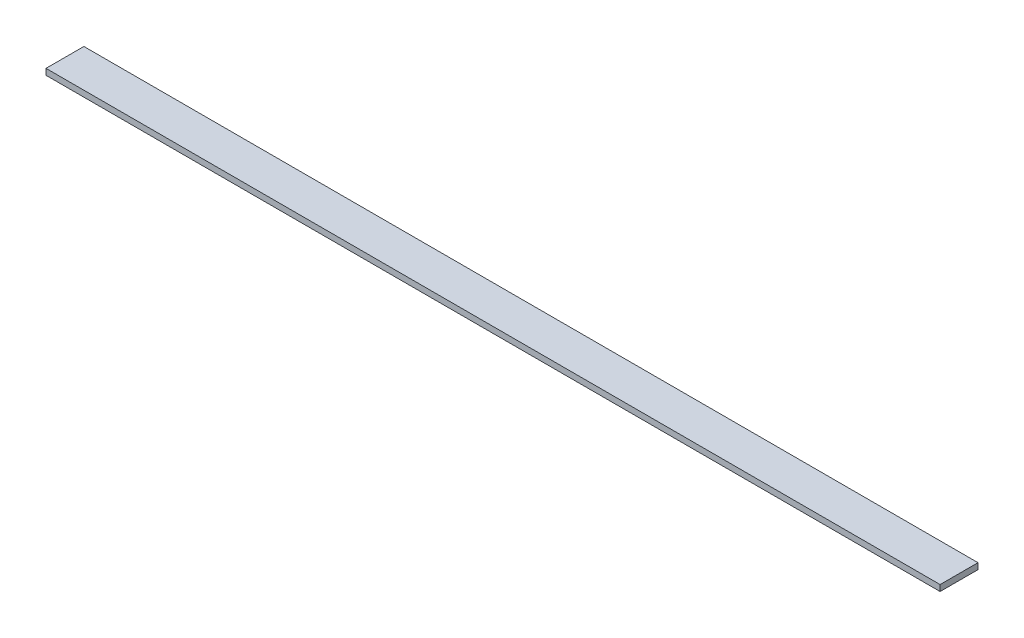
ISO-10303-21;
HEADER;
FILE_DESCRIPTION(('STEP AP214'),'2;1');
FILE_NAME('part.step','',(''),(''),'','','');
FILE_SCHEMA(('AUTOMOTIVE_DESIGN { 1 0 10303 214 1 1 1 1 }'));
ENDSEC;
DATA;
#1=APPLICATION_CONTEXT('core data for automotive mechanical design processes');
#2=APPLICATION_PROTOCOL_DEFINITION('international standard','automotive_design',2000,#1);
#3=PRODUCT_CONTEXT('',#1,'mechanical');
#4=PRODUCT('Part','Part','',(#3));
#5=PRODUCT_RELATED_PRODUCT_CATEGORY('part','',(#4));
#6=PRODUCT_DEFINITION_FORMATION('','',#4);
#7=PRODUCT_DEFINITION_CONTEXT('part definition',#1,'design');
#8=PRODUCT_DEFINITION('design','',#6,#7);
#9=PRODUCT_DEFINITION_SHAPE('','',#8);
#10=(LENGTH_UNIT() NAMED_UNIT(*) SI_UNIT(.MILLI.,.METRE.));
#11=(NAMED_UNIT(*) PLANE_ANGLE_UNIT() SI_UNIT($,.RADIAN.));
#12=(NAMED_UNIT(*) SI_UNIT($,.STERADIAN.) SOLID_ANGLE_UNIT());
#13=UNCERTAINTY_MEASURE_WITH_UNIT(LENGTH_MEASURE(1.E-05),#10,'distance_accuracy_value','');
#14=(GEOMETRIC_REPRESENTATION_CONTEXT(3) GLOBAL_UNCERTAINTY_ASSIGNED_CONTEXT((#13)) GLOBAL_UNIT_ASSIGNED_CONTEXT((#10,
#11,#12)) REPRESENTATION_CONTEXT('',''));
#15=CARTESIAN_POINT('',(0.,0.,0.));
#16=DIRECTION('',(0.,0.,1.));
#17=DIRECTION('',(1.,0.,0.));
#18=AXIS2_PLACEMENT_3D('',#15,#16,#17);
#19=CARTESIAN_POINT('',(590.,8.,-25.));
#20=DIRECTION('',(-1.,0.,0.));
#21=DIRECTION('',(0.,0.,1.));
#22=AXIS2_PLACEMENT_3D('',#19,#20,#21);
#23=PLANE('',#22);
#24=DIRECTION('',(0.,0.,-1.));
#25=VECTOR('',#24,1.);
#26=CARTESIAN_POINT('',(590.,0.,-25.));
#27=LINE('',#26,#25);
#28=CARTESIAN_POINT('',(590.,0.,25.));
#29=VERTEX_POINT('',#28);
#30=CARTESIAN_POINT('',(590.,0.,-25.));
#31=VERTEX_POINT('',#30);
#32=EDGE_CURVE('E100',#29,#31,#27,.T.);
#33=ORIENTED_EDGE('',*,*,#32,.T.);
#34=DIRECTION('',(0.,-1.,0.));
#35=VECTOR('',#34,1.);
#36=CARTESIAN_POINT('',(590.,8.,-25.));
#37=LINE('',#36,#35);
#38=CARTESIAN_POINT('',(590.,8.,-25.));
#39=VERTEX_POINT('',#38);
#40=EDGE_CURVE('E11',#39,#31,#37,.T.);
#41=ORIENTED_EDGE('',*,*,#40,.F.);
#42=DIRECTION('',(0.,0.,-1.));
#43=VECTOR('',#42,1.);
#44=CARTESIAN_POINT('',(590.,8.,-25.));
#45=LINE('',#44,#43);
#46=CARTESIAN_POINT('',(590.,8.,25.));
#47=VERTEX_POINT('',#46);
#48=EDGE_CURVE('E88',#47,#39,#45,.T.);
#49=ORIENTED_EDGE('',*,*,#48,.F.);
#50=DIRECTION('',(0.,-1.,0.));
#51=VECTOR('',#50,1.);
#52=CARTESIAN_POINT('',(590.,8.,25.));
#53=LINE('',#52,#51);
#54=EDGE_CURVE('E96',#47,#29,#53,.T.);
#55=ORIENTED_EDGE('',*,*,#54,.T.);
#56=EDGE_LOOP('',(#33,#41,#49,#55));
#57=FACE_BOUND('',#56,.T.);
#58=ADVANCED_FACE('F37',(#57),#23,.F.);
#59=CARTESIAN_POINT('',(-590.,8.,-25.));
#60=DIRECTION('',(0.,0.,1.));
#61=DIRECTION('',(1.,0.,0.));
#62=AXIS2_PLACEMENT_3D('',#59,#60,#61);
#63=PLANE('',#62);
#64=DIRECTION('',(-1.,0.,0.));
#65=VECTOR('',#64,1.);
#66=CARTESIAN_POINT('',(-590.,0.,-25.));
#67=LINE('',#66,#65);
#68=CARTESIAN_POINT('',(-590.,0.,-25.));
#69=VERTEX_POINT('',#68);
#70=EDGE_CURVE('E92',#31,#69,#67,.T.);
#71=ORIENTED_EDGE('',*,*,#70,.T.);
#72=DIRECTION('',(0.,-1.,0.));
#73=VECTOR('',#72,1.);
#74=CARTESIAN_POINT('',(-590.,8.,-25.));
#75=LINE('',#74,#73);
#76=CARTESIAN_POINT('',(-590.,8.,-25.));
#77=VERTEX_POINT('',#76);
#78=EDGE_CURVE('E45',#77,#69,#75,.T.);
#79=ORIENTED_EDGE('',*,*,#78,.F.);
#80=DIRECTION('',(-1.,0.,0.));
#81=VECTOR('',#80,1.);
#82=CARTESIAN_POINT('',(-590.,8.,-25.));
#83=LINE('',#82,#81);
#84=EDGE_CURVE('E83',#39,#77,#83,.T.);
#85=ORIENTED_EDGE('',*,*,#84,.F.);
#86=ORIENTED_EDGE('',*,*,#40,.T.);
#87=EDGE_LOOP('',(#71,#79,#85,#86));
#88=FACE_BOUND('',#87,.T.);
#89=ADVANCED_FACE('F91',(#88),#63,.F.);
#90=CARTESIAN_POINT('',(-590.,8.,-25.));
#91=DIRECTION('',(1.,0.,0.));
#92=DIRECTION('',(0.,0.,-1.));
#93=AXIS2_PLACEMENT_3D('',#90,#91,#92);
#94=PLANE('',#93);
#95=DIRECTION('',(0.,0.,1.));
#96=VECTOR('',#95,1.);
#97=CARTESIAN_POINT('',(-590.,0.,-25.));
#98=LINE('',#97,#96);
#99=CARTESIAN_POINT('',(-590.,0.,25.));
#100=VERTEX_POINT('',#99);
#101=EDGE_CURVE('E70',#69,#100,#98,.T.);
#102=ORIENTED_EDGE('',*,*,#101,.T.);
#103=DIRECTION('',(0.,-1.,0.));
#104=VECTOR('',#103,1.);
#105=CARTESIAN_POINT('',(-590.,8.,25.));
#106=LINE('',#105,#104);
#107=CARTESIAN_POINT('',(-590.,8.,25.));
#108=VERTEX_POINT('',#107);
#109=EDGE_CURVE('E93',#108,#100,#106,.T.);
#110=ORIENTED_EDGE('',*,*,#109,.F.);
#111=DIRECTION('',(0.,0.,1.));
#112=VECTOR('',#111,1.);
#113=CARTESIAN_POINT('',(-590.,8.,-25.));
#114=LINE('',#113,#112);
#115=EDGE_CURVE('E86',#77,#108,#114,.T.);
#116=ORIENTED_EDGE('',*,*,#115,.F.);
#117=ORIENTED_EDGE('',*,*,#78,.T.);
#118=EDGE_LOOP('',(#102,#110,#116,#117));
#119=FACE_BOUND('',#118,.T.);
#120=ADVANCED_FACE('F94',(#119),#94,.F.);
#121=CARTESIAN_POINT('',(-590.,8.,25.));
#122=DIRECTION('',(0.,0.,-1.));
#123=DIRECTION('',(-1.,0.,0.));
#124=AXIS2_PLACEMENT_3D('',#121,#122,#123);
#125=PLANE('',#124);
#126=DIRECTION('',(1.,0.,0.));
#127=VECTOR('',#126,1.);
#128=CARTESIAN_POINT('',(-590.,0.,25.));
#129=LINE('',#128,#127);
#130=EDGE_CURVE('E76',#100,#29,#129,.T.);
#131=ORIENTED_EDGE('',*,*,#130,.T.);
#132=ORIENTED_EDGE('',*,*,#54,.F.);
#133=DIRECTION('',(1.,0.,0.));
#134=VECTOR('',#133,1.);
#135=CARTESIAN_POINT('',(-590.,8.,25.));
#136=LINE('',#135,#134);
#137=EDGE_CURVE('E53',#108,#47,#136,.T.);
#138=ORIENTED_EDGE('',*,*,#137,.F.);
#139=ORIENTED_EDGE('',*,*,#109,.T.);
#140=EDGE_LOOP('',(#131,#132,#138,#139));
#141=FACE_BOUND('',#140,.T.);
#142=ADVANCED_FACE('F107',(#141),#125,.F.);
#143=CARTESIAN_POINT('',(0.,8.,0.));
#144=DIRECTION('',(0.,1.,0.));
#145=DIRECTION('',(0.,0.,1.));
#146=AXIS2_PLACEMENT_3D('',#143,#144,#145);
#147=PLANE('',#146);
#148=ORIENTED_EDGE('',*,*,#48,.T.);
#149=ORIENTED_EDGE('',*,*,#84,.T.);
#150=ORIENTED_EDGE('',*,*,#115,.T.);
#151=ORIENTED_EDGE('',*,*,#137,.T.);
#152=EDGE_LOOP('',(#148,#149,#150,#151));
#153=FACE_BOUND('',#152,.T.);
#154=ADVANCED_FACE('F84',(#153),#147,.T.);
#155=CARTESIAN_POINT('',(0.,0.,0.));
#156=DIRECTION('',(0.,1.,0.));
#157=DIRECTION('',(0.,0.,1.));
#158=AXIS2_PLACEMENT_3D('',#155,#156,#157);
#159=PLANE('',#158);
#160=ORIENTED_EDGE('',*,*,#32,.F.);
#161=ORIENTED_EDGE('',*,*,#130,.F.);
#162=ORIENTED_EDGE('',*,*,#101,.F.);
#163=ORIENTED_EDGE('',*,*,#70,.F.);
#164=EDGE_LOOP('',(#160,#161,#162,#163));
#165=FACE_BOUND('',#164,.T.);
#166=ADVANCED_FACE('F110',(#165),#159,.F.);
#167=CLOSED_SHELL('',(#58,#89,#120,#142,#154,#166));
#168=MANIFOLD_SOLID_BREP('B2',#167);
#169=ADVANCED_BREP_SHAPE_REPRESENTATION('',(#18,#168),#14);
#170=SHAPE_DEFINITION_REPRESENTATION(#9,#169);
ENDSEC;
END-ISO-10303-21;
